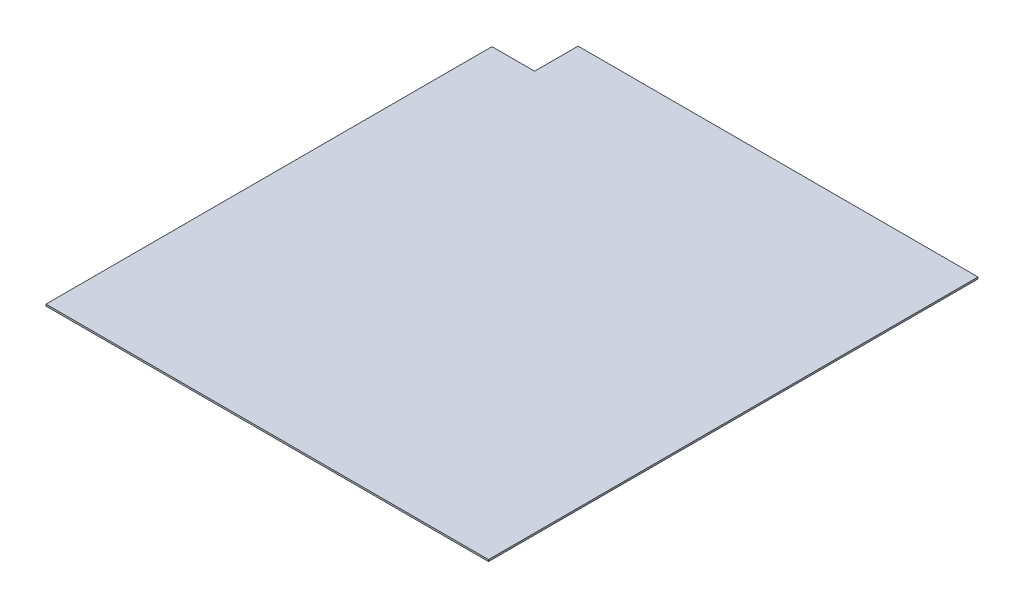
ISO-10303-21;
HEADER;
FILE_DESCRIPTION(('STEP AP214'),'2;1');
FILE_NAME('part.step','',(''),(''),'','','');
FILE_SCHEMA(('AUTOMOTIVE_DESIGN { 1 0 10303 214 1 1 1 1 }'));
ENDSEC;
DATA;
#1=APPLICATION_CONTEXT('core data for automotive mechanical design processes');
#2=APPLICATION_PROTOCOL_DEFINITION('international standard','automotive_design',2000,#1);
#3=PRODUCT_CONTEXT('',#1,'mechanical');
#4=PRODUCT('Part','Part','',(#3));
#5=PRODUCT_RELATED_PRODUCT_CATEGORY('part','',(#4));
#6=PRODUCT_DEFINITION_FORMATION('','',#4);
#7=PRODUCT_DEFINITION_CONTEXT('part definition',#1,'design');
#8=PRODUCT_DEFINITION('design','',#6,#7);
#9=PRODUCT_DEFINITION_SHAPE('','',#8);
#10=(LENGTH_UNIT() NAMED_UNIT(*) SI_UNIT(.MILLI.,.METRE.));
#11=(NAMED_UNIT(*) PLANE_ANGLE_UNIT() SI_UNIT($,.RADIAN.));
#12=(NAMED_UNIT(*) SI_UNIT($,.STERADIAN.) SOLID_ANGLE_UNIT());
#13=UNCERTAINTY_MEASURE_WITH_UNIT(LENGTH_MEASURE(1.E-05),#10,'distance_accuracy_value','');
#14=(GEOMETRIC_REPRESENTATION_CONTEXT(3) GLOBAL_UNCERTAINTY_ASSIGNED_CONTEXT((#13)) GLOBAL_UNIT_ASSIGNED_CONTEXT((#10,
#11,#12)) REPRESENTATION_CONTEXT('',''));
#15=CARTESIAN_POINT('',(0.,0.,0.));
#16=DIRECTION('',(0.,0.,1.));
#17=DIRECTION('',(1.,0.,0.));
#18=AXIS2_PLACEMENT_3D('',#15,#16,#17);
#19=CARTESIAN_POINT('',(0.,6.35000000000008,0.));
#20=DIRECTION('',(1.,0.,0.));
#21=DIRECTION('',(0.,0.,-1.));
#22=AXIS2_PLACEMENT_3D('',#19,#20,#21);
#23=PLANE('',#22);
#24=DIRECTION('',(0.,0.,1.));
#25=VECTOR('',#24,1.);
#26=CARTESIAN_POINT('',(0.,0.,0.));
#27=LINE('',#26,#25);
#28=CARTESIAN_POINT('',(0.,0.,-1625.6));
#29=VERTEX_POINT('',#28);
#30=CARTESIAN_POINT('',(0.,0.,0.));
#31=VERTEX_POINT('',#30);
#32=EDGE_CURVE('E137',#29,#31,#27,.T.);
#33=ORIENTED_EDGE('',*,*,#32,.T.);
#34=DIRECTION('',(0.,-1.,0.));
#35=VECTOR('',#34,1.);
#36=CARTESIAN_POINT('',(0.,6.35000000000008,0.));
#37=LINE('',#36,#35);
#38=CARTESIAN_POINT('',(0.,6.35000000000008,0.));
#39=VERTEX_POINT('',#38);
#40=EDGE_CURVE('E11',#39,#31,#37,.T.);
#41=ORIENTED_EDGE('',*,*,#40,.F.);
#42=DIRECTION('',(0.,0.,1.));
#43=VECTOR('',#42,1.);
#44=CARTESIAN_POINT('',(0.,6.35000000000008,0.));
#45=LINE('',#44,#43);
#46=CARTESIAN_POINT('',(0.,6.35000000000008,-1625.6));
#47=VERTEX_POINT('',#46);
#48=EDGE_CURVE('E153',#47,#39,#45,.T.);
#49=ORIENTED_EDGE('',*,*,#48,.F.);
#50=DIRECTION('',(0.,-1.,0.));
#51=VECTOR('',#50,1.);
#52=CARTESIAN_POINT('',(0.,6.35000000000008,-1625.6));
#53=LINE('',#52,#51);
#54=EDGE_CURVE('E133',#47,#29,#53,.T.);
#55=ORIENTED_EDGE('',*,*,#54,.T.);
#56=EDGE_LOOP('',(#33,#41,#49,#55));
#57=FACE_BOUND('',#56,.T.);
#58=ADVANCED_FACE('F35',(#57),#23,.F.);
#59=CARTESIAN_POINT('',(0.,6.35000000000008,0.));
#60=DIRECTION('',(0.,0.,-1.));
#61=DIRECTION('',(-1.,0.,0.));
#62=AXIS2_PLACEMENT_3D('',#59,#60,#61);
#63=PLANE('',#62);
#64=DIRECTION('',(1.,0.,0.));
#65=VECTOR('',#64,1.);
#66=CARTESIAN_POINT('',(0.,0.,0.));
#67=LINE('',#66,#65);
#68=CARTESIAN_POINT('',(1616.075,0.,0.));
#69=VERTEX_POINT('',#68);
#70=EDGE_CURVE('E140',#31,#69,#67,.T.);
#71=ORIENTED_EDGE('',*,*,#70,.T.);
#72=DIRECTION('',(0.,-1.,0.));
#73=VECTOR('',#72,1.);
#74=CARTESIAN_POINT('',(1616.075,6.35000000000008,0.));
#75=LINE('',#74,#73);
#76=CARTESIAN_POINT('',(1616.075,6.35000000000008,0.));
#77=VERTEX_POINT('',#76);
#78=EDGE_CURVE('E43',#77,#69,#75,.T.);
#79=ORIENTED_EDGE('',*,*,#78,.F.);
#80=DIRECTION('',(1.,0.,0.));
#81=VECTOR('',#80,1.);
#82=CARTESIAN_POINT('',(0.,6.35000000000008,0.));
#83=LINE('',#82,#81);
#84=EDGE_CURVE('E97',#39,#77,#83,.T.);
#85=ORIENTED_EDGE('',*,*,#84,.F.);
#86=ORIENTED_EDGE('',*,*,#40,.T.);
#87=EDGE_LOOP('',(#71,#79,#85,#86));
#88=FACE_BOUND('',#87,.T.);
#89=ADVANCED_FACE('F196',(#88),#63,.F.);
#90=CARTESIAN_POINT('',(1616.075,6.35000000000008,0.));
#91=DIRECTION('',(-1.,0.,0.));
#92=DIRECTION('',(0.,0.,1.));
#93=AXIS2_PLACEMENT_3D('',#90,#91,#92);
#94=PLANE('',#93);
#95=DIRECTION('',(0.,0.,-1.));
#96=VECTOR('',#95,1.);
#97=CARTESIAN_POINT('',(1616.075,0.,0.));
#98=LINE('',#97,#96);
#99=CARTESIAN_POINT('',(1616.075,0.,-1787.525));
#100=VERTEX_POINT('',#99);
#101=EDGE_CURVE('E142',#69,#100,#98,.T.);
#102=ORIENTED_EDGE('',*,*,#101,.T.);
#103=DIRECTION('',(0.,-1.,0.));
#104=VECTOR('',#103,1.);
#105=CARTESIAN_POINT('',(1616.075,6.35000000000008,-1787.525));
#106=LINE('',#105,#104);
#107=CARTESIAN_POINT('',(1616.075,6.35000000000008,-1787.525));
#108=VERTEX_POINT('',#107);
#109=EDGE_CURVE('E163',#108,#100,#106,.T.);
#110=ORIENTED_EDGE('',*,*,#109,.F.);
#111=DIRECTION('',(0.,0.,-1.));
#112=VECTOR('',#111,1.);
#113=CARTESIAN_POINT('',(1616.075,6.35000000000008,0.));
#114=LINE('',#113,#112);
#115=EDGE_CURVE('E171',#77,#108,#114,.T.);
#116=ORIENTED_EDGE('',*,*,#115,.F.);
#117=ORIENTED_EDGE('',*,*,#78,.T.);
#118=EDGE_LOOP('',(#102,#110,#116,#117));
#119=FACE_BOUND('',#118,.T.);
#120=ADVANCED_FACE('F169',(#119),#94,.F.);
#121=CARTESIAN_POINT('',(158.75,6.35000000000008,-1787.525));
#122=DIRECTION('',(0.,0.,1.));
#123=DIRECTION('',(1.,0.,0.));
#124=AXIS2_PLACEMENT_3D('',#121,#122,#123);
#125=PLANE('',#124);
#126=DIRECTION('',(-1.,0.,0.));
#127=VECTOR('',#126,1.);
#128=CARTESIAN_POINT('',(158.75,0.,-1787.525));
#129=LINE('',#128,#127);
#130=CARTESIAN_POINT('',(158.75,0.,-1787.525));
#131=VERTEX_POINT('',#130);
#132=EDGE_CURVE('E144',#100,#131,#129,.T.);
#133=ORIENTED_EDGE('',*,*,#132,.T.);
#134=DIRECTION('',(0.,-1.,0.));
#135=VECTOR('',#134,1.);
#136=CARTESIAN_POINT('',(158.75,6.35000000000008,-1787.525));
#137=LINE('',#136,#135);
#138=CARTESIAN_POINT('',(158.75,6.35000000000008,-1787.525));
#139=VERTEX_POINT('',#138);
#140=EDGE_CURVE('E160',#139,#131,#137,.T.);
#141=ORIENTED_EDGE('',*,*,#140,.F.);
#142=DIRECTION('',(-1.,0.,0.));
#143=VECTOR('',#142,1.);
#144=CARTESIAN_POINT('',(158.75,6.35000000000008,-1787.525));
#145=LINE('',#144,#143);
#146=EDGE_CURVE('E187',#108,#139,#145,.T.);
#147=ORIENTED_EDGE('',*,*,#146,.F.);
#148=ORIENTED_EDGE('',*,*,#109,.T.);
#149=EDGE_LOOP('',(#133,#141,#147,#148));
#150=FACE_BOUND('',#149,.T.);
#151=ADVANCED_FACE('F180',(#150),#125,.F.);
#152=CARTESIAN_POINT('',(158.75,6.35000000000008,-1784.35));
#153=DIRECTION('',(0.,-1.,0.));
#154=DIRECTION('',(0.,0.,-1.));
#155=AXIS2_PLACEMENT_3D('',#152,#153,#154);
#156=CYLINDRICAL_SURFACE('',#155,3.17499999999986);
#157=CARTESIAN_POINT('',(158.75,0.,-1784.35));
#158=DIRECTION('',(0.,1.,0.));
#159=DIRECTION('',(0.,0.,-1.));
#160=AXIS2_PLACEMENT_3D('',#157,#158,#159);
#161=CIRCLE('',#160,3.17499999999986);
#162=CARTESIAN_POINT('',(155.575,0.,-1784.35));
#163=VERTEX_POINT('',#162);
#164=EDGE_CURVE('E146',#131,#163,#161,.T.);
#165=ORIENTED_EDGE('',*,*,#164,.T.);
#166=DIRECTION('',(0.,-1.,0.));
#167=VECTOR('',#166,1.);
#168=CARTESIAN_POINT('',(155.575,6.35000000000008,-1784.35));
#169=LINE('',#168,#167);
#170=CARTESIAN_POINT('',(155.575,6.35000000000008,-1784.35));
#171=VERTEX_POINT('',#170);
#172=EDGE_CURVE('E157',#171,#163,#169,.T.);
#173=ORIENTED_EDGE('',*,*,#172,.F.);
#174=CARTESIAN_POINT('',(158.75,6.35000000000008,-1784.35));
#175=DIRECTION('',(0.,1.,0.));
#176=DIRECTION('',(0.,0.,-1.));
#177=AXIS2_PLACEMENT_3D('',#174,#175,#176);
#178=CIRCLE('',#177,3.17499999999986);
#179=EDGE_CURVE('E186',#139,#171,#178,.T.);
#180=ORIENTED_EDGE('',*,*,#179,.F.);
#181=ORIENTED_EDGE('',*,*,#140,.T.);
#182=EDGE_LOOP('',(#165,#173,#180,#181));
#183=FACE_BOUND('',#182,.T.);
#184=ADVANCED_FACE('F184',(#183),#156,.T.);
#185=CARTESIAN_POINT('',(155.575,6.35000000000008,-1631.95));
#186=DIRECTION('',(1.,0.,0.));
#187=DIRECTION('',(0.,0.,-1.));
#188=AXIS2_PLACEMENT_3D('',#185,#186,#187);
#189=PLANE('',#188);
#190=DIRECTION('',(0.,0.,1.));
#191=VECTOR('',#190,1.);
#192=CARTESIAN_POINT('',(155.575,0.,-1631.95));
#193=LINE('',#192,#191);
#194=CARTESIAN_POINT('',(155.575,0.,-1631.95));
#195=VERTEX_POINT('',#194);
#196=EDGE_CURVE('E148',#163,#195,#193,.T.);
#197=ORIENTED_EDGE('',*,*,#196,.T.);
#198=DIRECTION('',(0.,-1.,0.));
#199=VECTOR('',#198,1.);
#200=CARTESIAN_POINT('',(155.575,6.35000000000008,-1631.95));
#201=LINE('',#200,#199);
#202=CARTESIAN_POINT('',(155.575,6.35000000000008,-1631.95));
#203=VERTEX_POINT('',#202);
#204=EDGE_CURVE('E128',#203,#195,#201,.T.);
#205=ORIENTED_EDGE('',*,*,#204,.F.);
#206=DIRECTION('',(0.,0.,1.));
#207=VECTOR('',#206,1.);
#208=CARTESIAN_POINT('',(155.575,6.35000000000008,-1631.95));
#209=LINE('',#208,#207);
#210=EDGE_CURVE('E119',#171,#203,#209,.T.);
#211=ORIENTED_EDGE('',*,*,#210,.F.);
#212=ORIENTED_EDGE('',*,*,#172,.T.);
#213=EDGE_LOOP('',(#197,#205,#211,#212));
#214=FACE_BOUND('',#213,.T.);
#215=ADVANCED_FACE('F208',(#214),#189,.F.);
#216=CARTESIAN_POINT('',(152.4,6.35000000000008,-1631.95));
#217=DIRECTION('',(0.,-1.,0.));
#218=DIRECTION('',(0.,0.,-1.));
#219=AXIS2_PLACEMENT_3D('',#216,#217,#218);
#220=CYLINDRICAL_SURFACE('',#219,3.17499999999997);
#221=CARTESIAN_POINT('',(152.4,0.,-1631.95));
#222=DIRECTION('',(0.,-1.,0.));
#223=DIRECTION('',(0.,0.,-1.));
#224=AXIS2_PLACEMENT_3D('',#221,#222,#223);
#225=CIRCLE('',#224,3.17499999999997);
#226=CARTESIAN_POINT('',(152.4,0.,-1628.775));
#227=VERTEX_POINT('',#226);
#228=EDGE_CURVE('E127',#195,#227,#225,.T.);
#229=ORIENTED_EDGE('',*,*,#228,.T.);
#230=DIRECTION('',(0.,-1.,0.));
#231=VECTOR('',#230,1.);
#232=CARTESIAN_POINT('',(152.4,6.35000000000008,-1628.775));
#233=LINE('',#232,#231);
#234=CARTESIAN_POINT('',(152.4,6.35000000000008,-1628.775));
#235=VERTEX_POINT('',#234);
#236=EDGE_CURVE('E124',#235,#227,#233,.T.);
#237=ORIENTED_EDGE('',*,*,#236,.F.);
#238=CARTESIAN_POINT('',(152.4,6.35000000000008,-1631.95));
#239=DIRECTION('',(0.,-1.,0.));
#240=DIRECTION('',(0.,0.,-1.));
#241=AXIS2_PLACEMENT_3D('',#238,#239,#240);
#242=CIRCLE('',#241,3.17499999999997);
#243=EDGE_CURVE('E113',#203,#235,#242,.T.);
#244=ORIENTED_EDGE('',*,*,#243,.F.);
#245=ORIENTED_EDGE('',*,*,#204,.T.);
#246=EDGE_LOOP('',(#229,#237,#244,#245));
#247=FACE_BOUND('',#246,.T.);
#248=ADVANCED_FACE('F125',(#247),#220,.F.);
#249=CARTESIAN_POINT('',(3.175,6.35000000000008,-1628.775));
#250=DIRECTION('',(0.,0.,1.));
#251=DIRECTION('',(1.,0.,0.));
#252=AXIS2_PLACEMENT_3D('',#249,#250,#251);
#253=PLANE('',#252);
#254=DIRECTION('',(-1.,0.,0.));
#255=VECTOR('',#254,1.);
#256=CARTESIAN_POINT('',(3.175,0.,-1628.775));
#257=LINE('',#256,#255);
#258=CARTESIAN_POINT('',(3.175,0.,-1628.775));
#259=VERTEX_POINT('',#258);
#260=EDGE_CURVE('E83',#227,#259,#257,.T.);
#261=ORIENTED_EDGE('',*,*,#260,.T.);
#262=DIRECTION('',(0.,-1.,0.));
#263=VECTOR('',#262,1.);
#264=CARTESIAN_POINT('',(3.175,6.35000000000008,-1628.775));
#265=LINE('',#264,#263);
#266=CARTESIAN_POINT('',(3.175,6.35000000000008,-1628.775));
#267=VERTEX_POINT('',#266);
#268=EDGE_CURVE('E129',#267,#259,#265,.T.);
#269=ORIENTED_EDGE('',*,*,#268,.F.);
#270=DIRECTION('',(-1.,0.,0.));
#271=VECTOR('',#270,1.);
#272=CARTESIAN_POINT('',(3.175,6.35000000000008,-1628.775));
#273=LINE('',#272,#271);
#274=EDGE_CURVE('E117',#235,#267,#273,.T.);
#275=ORIENTED_EDGE('',*,*,#274,.F.);
#276=ORIENTED_EDGE('',*,*,#236,.T.);
#277=EDGE_LOOP('',(#261,#269,#275,#276));
#278=FACE_BOUND('',#277,.T.);
#279=ADVANCED_FACE('F131',(#278),#253,.F.);
#280=CARTESIAN_POINT('',(3.175,6.35000000000008,-1625.6));
#281=DIRECTION('',(0.,-1.,0.));
#282=DIRECTION('',(0.,0.,-1.));
#283=AXIS2_PLACEMENT_3D('',#280,#281,#282);
#284=CYLINDRICAL_SURFACE('',#283,3.17499999999996);
#285=CARTESIAN_POINT('',(3.175,0.,-1625.6));
#286=DIRECTION('',(0.,1.,0.));
#287=DIRECTION('',(0.,0.,1.));
#288=AXIS2_PLACEMENT_3D('',#285,#286,#287);
#289=CIRCLE('',#288,3.17499999999996);
#290=EDGE_CURVE('E89',#259,#29,#289,.T.);
#291=ORIENTED_EDGE('',*,*,#290,.T.);
#292=ORIENTED_EDGE('',*,*,#54,.F.);
#293=CARTESIAN_POINT('',(3.175,6.35000000000008,-1625.6));
#294=DIRECTION('',(0.,1.,0.));
#295=DIRECTION('',(0.,0.,1.));
#296=AXIS2_PLACEMENT_3D('',#293,#294,#295);
#297=CIRCLE('',#296,3.17499999999996);
#298=EDGE_CURVE('E51',#267,#47,#297,.T.);
#299=ORIENTED_EDGE('',*,*,#298,.F.);
#300=ORIENTED_EDGE('',*,*,#268,.T.);
#301=EDGE_LOOP('',(#291,#292,#299,#300));
#302=FACE_BOUND('',#301,.T.);
#303=ADVANCED_FACE('F216',(#302),#284,.T.);
#304=CARTESIAN_POINT('',(3.175,6.35000000000008,-1625.6));
#305=DIRECTION('',(0.,1.,0.));
#306=DIRECTION('',(0.,0.,1.));
#307=AXIS2_PLACEMENT_3D('',#304,#305,#306);
#308=PLANE('',#307);
#309=ORIENTED_EDGE('',*,*,#48,.T.);
#310=ORIENTED_EDGE('',*,*,#84,.T.);
#311=ORIENTED_EDGE('',*,*,#115,.T.);
#312=ORIENTED_EDGE('',*,*,#146,.T.);
#313=ORIENTED_EDGE('',*,*,#179,.T.);
#314=ORIENTED_EDGE('',*,*,#210,.T.);
#315=ORIENTED_EDGE('',*,*,#243,.T.);
#316=ORIENTED_EDGE('',*,*,#274,.T.);
#317=ORIENTED_EDGE('',*,*,#298,.T.);
#318=EDGE_LOOP('',(#309,#310,#311,#312,#313,#314,#315,#316,#317));
#319=FACE_BOUND('',#318,.T.);
#320=ADVANCED_FACE('F115',(#319),#308,.T.);
#321=CARTESIAN_POINT('',(3.175,0.,-1625.6));
#322=DIRECTION('',(0.,1.,0.));
#323=DIRECTION('',(0.,0.,1.));
#324=AXIS2_PLACEMENT_3D('',#321,#322,#323);
#325=PLANE('',#324);
#326=ORIENTED_EDGE('',*,*,#32,.F.);
#327=ORIENTED_EDGE('',*,*,#290,.F.);
#328=ORIENTED_EDGE('',*,*,#260,.F.);
#329=ORIENTED_EDGE('',*,*,#228,.F.);
#330=ORIENTED_EDGE('',*,*,#196,.F.);
#331=ORIENTED_EDGE('',*,*,#164,.F.);
#332=ORIENTED_EDGE('',*,*,#132,.F.);
#333=ORIENTED_EDGE('',*,*,#101,.F.);
#334=ORIENTED_EDGE('',*,*,#70,.F.);
#335=EDGE_LOOP('',(#326,#327,#328,#329,#330,#331,#332,#333,#334));
#336=FACE_BOUND('',#335,.T.);
#337=ADVANCED_FACE('F175',(#336),#325,.F.);
#338=CLOSED_SHELL('',(#58,#89,#120,#151,#184,#215,#248,#279,#303,#320,#337));
#339=MANIFOLD_SOLID_BREP('B2',#338);
#340=ADVANCED_BREP_SHAPE_REPRESENTATION('',(#18,#339),#14);
#341=SHAPE_DEFINITION_REPRESENTATION(#9,#340);
ENDSEC;
END-ISO-10303-21;
